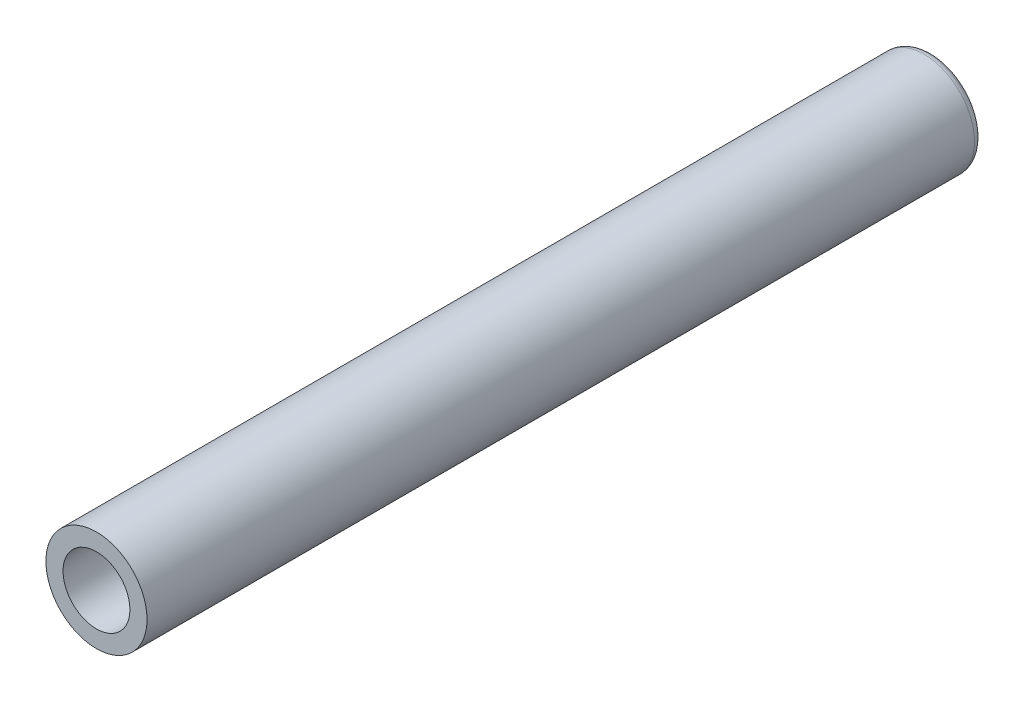
ISO-10303-21;
HEADER;
FILE_DESCRIPTION(('STEP AP214'),'2;1');
FILE_NAME('part.step','',(''),(''),'','','');
FILE_SCHEMA(('AUTOMOTIVE_DESIGN { 1 0 10303 214 1 1 1 1 }'));
ENDSEC;
DATA;
#1=APPLICATION_CONTEXT('core data for automotive mechanical design processes');
#2=APPLICATION_PROTOCOL_DEFINITION('international standard','automotive_design',2000,#1);
#3=PRODUCT_CONTEXT('',#1,'mechanical');
#4=PRODUCT('Part','Part','',(#3));
#5=PRODUCT_RELATED_PRODUCT_CATEGORY('part','',(#4));
#6=PRODUCT_DEFINITION_FORMATION('','',#4);
#7=PRODUCT_DEFINITION_CONTEXT('part definition',#1,'design');
#8=PRODUCT_DEFINITION('design','',#6,#7);
#9=PRODUCT_DEFINITION_SHAPE('','',#8);
#10=(LENGTH_UNIT() NAMED_UNIT(*) SI_UNIT(.MILLI.,.METRE.));
#11=(NAMED_UNIT(*) PLANE_ANGLE_UNIT() SI_UNIT($,.RADIAN.));
#12=(NAMED_UNIT(*) SI_UNIT($,.STERADIAN.) SOLID_ANGLE_UNIT());
#13=UNCERTAINTY_MEASURE_WITH_UNIT(LENGTH_MEASURE(1.E-05),#10,'distance_accuracy_value','');
#14=(GEOMETRIC_REPRESENTATION_CONTEXT(3) GLOBAL_UNCERTAINTY_ASSIGNED_CONTEXT((#13)) GLOBAL_UNIT_ASSIGNED_CONTEXT((#10,
#11,#12)) REPRESENTATION_CONTEXT('',''));
#15=CARTESIAN_POINT('',(0.,0.,0.));
#16=DIRECTION('',(0.,0.,1.));
#17=DIRECTION('',(1.,0.,0.));
#18=AXIS2_PLACEMENT_3D('',#15,#16,#17);
#19=CARTESIAN_POINT('',(0.,0.,-50.));
#20=DIRECTION('',(0.,0.,1.));
#21=DIRECTION('',(1.,0.,0.));
#22=AXIS2_PLACEMENT_3D('',#19,#20,#21);
#23=CYLINDRICAL_SURFACE('',#22,3.025);
#24=CARTESIAN_POINT('',(0.,0.,-49.5));
#25=DIRECTION('',(0.,0.,1.));
#26=DIRECTION('',(1.,0.,0.));
#27=AXIS2_PLACEMENT_3D('',#24,#25,#26);
#28=CIRCLE('',#27,3.025);
#29=CARTESIAN_POINT('',(3.025,0.,-49.5));
#30=VERTEX_POINT('',#29);
#31=EDGE_CURVE('E47',#30,#30,#28,.T.);
#32=ORIENTED_EDGE('',*,*,#31,.T.);
#33=EDGE_LOOP('',(#32));
#34=FACE_BOUND('',#33,.T.);
#35=CARTESIAN_POINT('',(0.,0.,0.));
#36=DIRECTION('',(0.,0.,1.));
#37=DIRECTION('',(1.,0.,0.));
#38=AXIS2_PLACEMENT_3D('',#35,#36,#37);
#39=CIRCLE('',#38,3.025);
#40=CARTESIAN_POINT('',(3.025,0.,0.));
#41=VERTEX_POINT('',#40);
#42=EDGE_CURVE('E51',#41,#41,#39,.T.);
#43=ORIENTED_EDGE('',*,*,#42,.F.);
#44=EDGE_LOOP('',(#43));
#45=FACE_BOUND('',#44,.T.);
#46=ADVANCED_FACE('F40',(#34,#45),#23,.T.);
#47=CARTESIAN_POINT('',(0.,0.,-50.));
#48=DIRECTION('',(0.,0.,1.));
#49=DIRECTION('',(1.,0.,0.));
#50=AXIS2_PLACEMENT_3D('',#47,#48,#49);
#51=PLANE('',#50);
#52=CARTESIAN_POINT('',(0.,0.,-50.));
#53=DIRECTION('',(0.,0.,1.));
#54=DIRECTION('',(1.,0.,0.));
#55=AXIS2_PLACEMENT_3D('',#52,#53,#54);
#56=CIRCLE('',#55,2.525);
#57=CARTESIAN_POINT('',(2.525,0.,-50.));
#58=VERTEX_POINT('',#57);
#59=EDGE_CURVE('E10',#58,#58,#56,.F.);
#60=ORIENTED_EDGE('',*,*,#59,.T.);
#61=EDGE_LOOP('',(#60));
#62=FACE_BOUND('',#61,.T.);
#63=ADVANCED_FACE('F75',(#62),#51,.F.);
#64=CARTESIAN_POINT('',(0.,0.,0.));
#65=DIRECTION('',(0.,0.,1.));
#66=DIRECTION('',(1.,0.,0.));
#67=AXIS2_PLACEMENT_3D('',#64,#65,#66);
#68=PLANE('',#67);
#69=CARTESIAN_POINT('',(0.,0.,0.));
#70=DIRECTION('',(0.,0.,1.));
#71=DIRECTION('',(1.,0.,0.));
#72=AXIS2_PLACEMENT_3D('',#69,#70,#71);
#73=CIRCLE('',#72,2.);
#74=CARTESIAN_POINT('',(2.,0.,0.));
#75=VERTEX_POINT('',#74);
#76=EDGE_CURVE('E58',#75,#75,#73,.T.);
#77=ORIENTED_EDGE('',*,*,#76,.F.);
#78=EDGE_LOOP('',(#77));
#79=FACE_BOUND('',#78,.T.);
#80=ORIENTED_EDGE('',*,*,#42,.T.);
#81=EDGE_LOOP('',(#80));
#82=FACE_BOUND('',#81,.T.);
#83=ADVANCED_FACE('F69',(#79,#82),#68,.T.);
#84=CARTESIAN_POINT('',(0.,0.,-5.));
#85=DIRECTION('',(0.,0.,1.));
#86=DIRECTION('',(1.,0.,0.));
#87=AXIS2_PLACEMENT_3D('',#84,#85,#86);
#88=CYLINDRICAL_SURFACE('',#87,2.);
#89=CARTESIAN_POINT('',(0.,0.,-5.));
#90=DIRECTION('',(0.,0.,1.));
#91=DIRECTION('',(1.,0.,0.));
#92=AXIS2_PLACEMENT_3D('',#89,#90,#91);
#93=CIRCLE('',#92,2.);
#94=CARTESIAN_POINT('',(2.,0.,-5.));
#95=VERTEX_POINT('',#94);
#96=EDGE_CURVE('E55',#95,#95,#93,.T.);
#97=ORIENTED_EDGE('',*,*,#96,.F.);
#98=EDGE_LOOP('',(#97));
#99=FACE_BOUND('',#98,.T.);
#100=ORIENTED_EDGE('',*,*,#76,.T.);
#101=EDGE_LOOP('',(#100));
#102=FACE_BOUND('',#101,.T.);
#103=ADVANCED_FACE('F66',(#99,#102),#88,.F.);
#104=CARTESIAN_POINT('',(0.,0.,-5.));
#105=DIRECTION('',(0.,0.,1.));
#106=DIRECTION('',(1.,0.,0.));
#107=AXIS2_PLACEMENT_3D('',#104,#105,#106);
#108=PLANE('',#107);
#109=ORIENTED_EDGE('',*,*,#96,.T.);
#110=EDGE_LOOP('',(#109));
#111=FACE_BOUND('',#110,.T.);
#112=ADVANCED_FACE('F64',(#111),#108,.T.);
#113=CARTESIAN_POINT('',(0.,0.,-49.5));
#114=DIRECTION('',(0.,0.,1.));
#115=DIRECTION('',(1.,0.,0.));
#116=AXIS2_PLACEMENT_3D('',#113,#114,#115);
#117=TOROIDAL_SURFACE('',#116,2.525,0.5);
#118=ORIENTED_EDGE('',*,*,#59,.F.);
#119=EDGE_LOOP('',(#118));
#120=FACE_BOUND('',#119,.T.);
#121=ORIENTED_EDGE('',*,*,#31,.F.);
#122=EDGE_LOOP('',(#121));
#123=FACE_BOUND('',#122,.T.);
#124=ADVANCED_FACE('F42',(#120,#123),#117,.T.);
#125=CLOSED_SHELL('',(#46,#63,#83,#103,#112,#124));
#126=MANIFOLD_SOLID_BREP('B2',#125);
#127=ADVANCED_BREP_SHAPE_REPRESENTATION('',(#18,#126),#14);
#128=SHAPE_DEFINITION_REPRESENTATION(#9,#127);
ENDSEC;
END-ISO-10303-21;
